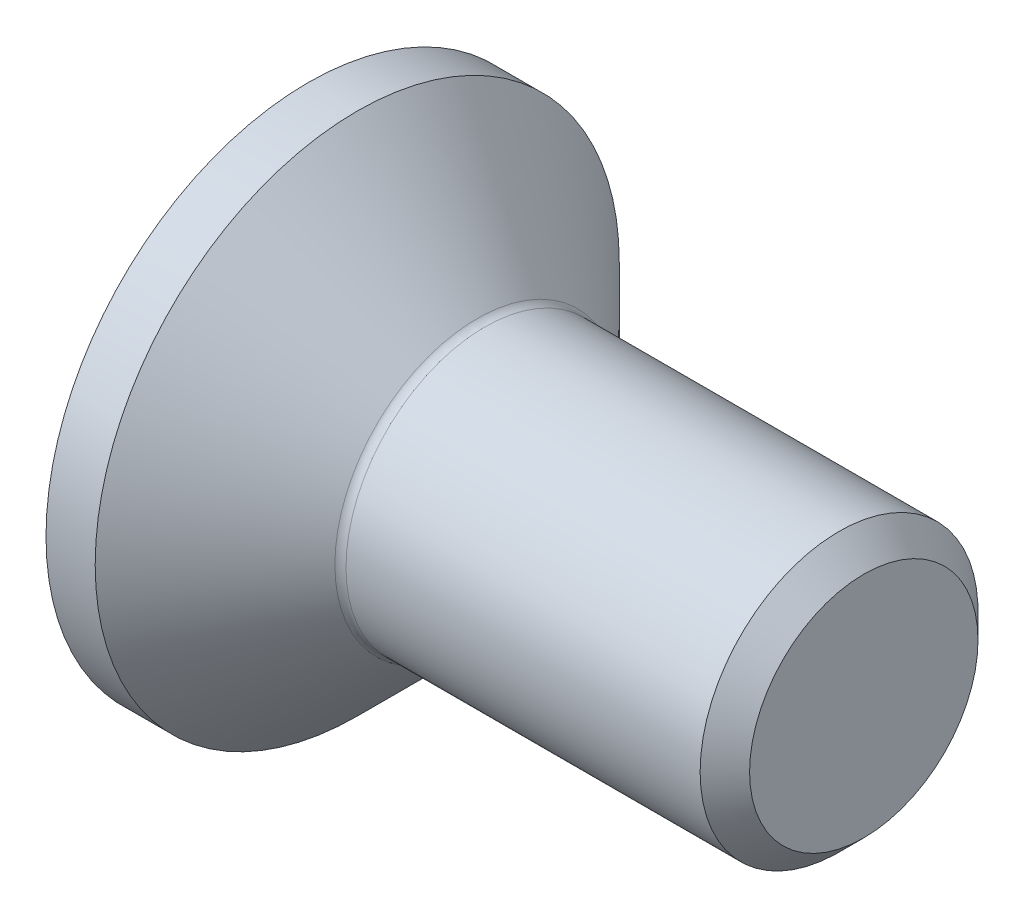
ISO-10303-21;
HEADER;
FILE_DESCRIPTION(('STEP AP214'),'2;1');
FILE_NAME('part.step','',(''),(''),'','','');
FILE_SCHEMA(('AUTOMOTIVE_DESIGN { 1 0 10303 214 1 1 1 1 }'));
ENDSEC;
DATA;
#1=APPLICATION_CONTEXT('core data for automotive mechanical design processes');
#2=APPLICATION_PROTOCOL_DEFINITION('international standard','automotive_design',2000,#1);
#3=PRODUCT_CONTEXT('',#1,'mechanical');
#4=PRODUCT('Part','Part','',(#3));
#5=PRODUCT_RELATED_PRODUCT_CATEGORY('part','',(#4));
#6=PRODUCT_DEFINITION_FORMATION('','',#4);
#7=PRODUCT_DEFINITION_CONTEXT('part definition',#1,'design');
#8=PRODUCT_DEFINITION('design','',#6,#7);
#9=PRODUCT_DEFINITION_SHAPE('','',#8);
#10=(LENGTH_UNIT() NAMED_UNIT(*) SI_UNIT(.MILLI.,.METRE.));
#11=(NAMED_UNIT(*) PLANE_ANGLE_UNIT() SI_UNIT($,.RADIAN.));
#12=(NAMED_UNIT(*) SI_UNIT($,.STERADIAN.) SOLID_ANGLE_UNIT());
#13=UNCERTAINTY_MEASURE_WITH_UNIT(LENGTH_MEASURE(1.E-05),#10,'distance_accuracy_value','');
#14=(GEOMETRIC_REPRESENTATION_CONTEXT(3) GLOBAL_UNCERTAINTY_ASSIGNED_CONTEXT((#13)) GLOBAL_UNIT_ASSIGNED_CONTEXT((#10,
#11,#12)) REPRESENTATION_CONTEXT('',''));
#15=CARTESIAN_POINT('',(0.,0.,0.));
#16=DIRECTION('',(0.,0.,1.));
#17=DIRECTION('',(1.,0.,0.));
#18=AXIS2_PLACEMENT_3D('',#15,#16,#17);
#19=CARTESIAN_POINT('',(0.,0.,0.));
#20=DIRECTION('',(-1.,0.,0.));
#21=DIRECTION('',(0.,0.,1.));
#22=AXIS2_PLACEMENT_3D('',#19,#20,#21);
#23=PLANE('',#22);
#24=CARTESIAN_POINT('',(0.,0.,0.));
#25=DIRECTION('',(-1.,0.,0.));
#26=DIRECTION('',(0.,0.,1.));
#27=AXIS2_PLACEMENT_3D('',#24,#25,#26);
#28=CIRCLE('',#27,4.715);
#29=CARTESIAN_POINT('',(0.,0.,4.715));
#30=VERTEX_POINT('',#29);
#31=EDGE_CURVE('E140',#30,#30,#28,.T.);
#32=ORIENTED_EDGE('',*,*,#31,.T.);
#33=EDGE_LOOP('',(#32));
#34=FACE_BOUND('',#33,.T.);
#35=DIRECTION('',(0.,-0.5,-0.866025403784439));
#36=VECTOR('',#35,1.);
#37=CARTESIAN_POINT('',(0.,-0.866025403784438,1.5));
#38=LINE('',#37,#36);
#39=CARTESIAN_POINT('',(0.,-0.866025403784438,1.5));
#40=VERTEX_POINT('',#39);
#41=CARTESIAN_POINT('',(0.,-1.73205080756887,0.));
#42=VERTEX_POINT('',#41);
#43=EDGE_CURVE('E102',#40,#42,#38,.T.);
#44=ORIENTED_EDGE('',*,*,#43,.T.);
#45=DIRECTION('',(0.,0.5,-0.866025403784439));
#46=VECTOR('',#45,1.);
#47=CARTESIAN_POINT('',(0.,-1.73205080756887,0.));
#48=LINE('',#47,#46);
#49=CARTESIAN_POINT('',(0.,-0.866025403784438,-1.5));
#50=VERTEX_POINT('',#49);
#51=EDGE_CURVE('E32',#42,#50,#48,.T.);
#52=ORIENTED_EDGE('',*,*,#51,.T.);
#53=DIRECTION('',(0.,1.,0.));
#54=VECTOR('',#53,1.);
#55=CARTESIAN_POINT('',(0.,-0.866025403784438,-1.5));
#56=LINE('',#55,#54);
#57=CARTESIAN_POINT('',(0.,0.866025403784438,-1.5));
#58=VERTEX_POINT('',#57);
#59=EDGE_CURVE('E117',#50,#58,#56,.T.);
#60=ORIENTED_EDGE('',*,*,#59,.T.);
#61=DIRECTION('',(0.,0.5,0.866025403784438));
#62=VECTOR('',#61,1.);
#63=CARTESIAN_POINT('',(0.,0.866025403784438,-1.5));
#64=LINE('',#63,#62);
#65=CARTESIAN_POINT('',(0.,1.73205080756888,0.));
#66=VERTEX_POINT('',#65);
#67=EDGE_CURVE('E258',#58,#66,#64,.T.);
#68=ORIENTED_EDGE('',*,*,#67,.T.);
#69=DIRECTION('',(0.,-0.5,0.866025403784438));
#70=VECTOR('',#69,1.);
#71=CARTESIAN_POINT('',(0.,1.73205080756888,0.));
#72=LINE('',#71,#70);
#73=CARTESIAN_POINT('',(0.,0.866025403784438,1.5));
#74=VERTEX_POINT('',#73);
#75=EDGE_CURVE('E261',#66,#74,#72,.T.);
#76=ORIENTED_EDGE('',*,*,#75,.T.);
#77=DIRECTION('',(0.,-1.,0.));
#78=VECTOR('',#77,1.);
#79=CARTESIAN_POINT('',(0.,0.866025403784438,1.5));
#80=LINE('',#79,#78);
#81=EDGE_CURVE('E264',#74,#40,#80,.T.);
#82=ORIENTED_EDGE('',*,*,#81,.T.);
#83=EDGE_LOOP('',(#44,#52,#60,#68,#76,#82));
#84=FACE_BOUND('',#83,.T.);
#85=ADVANCED_FACE('F17',(#34,#84),#23,.T.);
#86=CARTESIAN_POINT('',(0.,0.,0.));
#87=DIRECTION('',(-1.,0.,0.));
#88=DIRECTION('',(0.,0.,1.));
#89=AXIS2_PLACEMENT_3D('',#86,#87,#88);
#90=CYLINDRICAL_SURFACE('',#89,4.715);
#91=CARTESIAN_POINT('',(0.885000000000013,0.,0.));
#92=DIRECTION('',(-1.,0.,0.));
#93=DIRECTION('',(0.,0.,1.));
#94=AXIS2_PLACEMENT_3D('',#91,#92,#93);
#95=CIRCLE('',#94,4.715);
#96=CARTESIAN_POINT('',(0.885000000000013,0.,4.715));
#97=VERTEX_POINT('',#96);
#98=EDGE_CURVE('E137',#97,#97,#95,.T.);
#99=ORIENTED_EDGE('',*,*,#98,.T.);
#100=EDGE_LOOP('',(#99));
#101=FACE_BOUND('',#100,.T.);
#102=ORIENTED_EDGE('',*,*,#31,.F.);
#103=EDGE_LOOP('',(#102));
#104=FACE_BOUND('',#103,.T.);
#105=ADVANCED_FACE('F163',(#101,#104),#90,.T.);
#106=CARTESIAN_POINT('',(0.885000000000013,0.,0.));
#107=DIRECTION('',(-1.,0.,0.));
#108=DIRECTION('',(0.,0.,1.));
#109=AXIS2_PLACEMENT_3D('',#106,#107,#108);
#110=CONICAL_SURFACE('',#109,4.715,0.78539816339745);
#111=CARTESIAN_POINT('',(3.04142135623731,0.,0.));
#112=DIRECTION('',(-1.,0.,0.));
#113=DIRECTION('',(0.,0.,1.));
#114=AXIS2_PLACEMENT_3D('',#111,#112,#113);
#115=CIRCLE('',#114,2.55857864376269);
#116=CARTESIAN_POINT('',(3.04142135623731,0.,2.55857864376269));
#117=VERTEX_POINT('',#116);
#118=EDGE_CURVE('E25',#117,#117,#115,.T.);
#119=ORIENTED_EDGE('',*,*,#118,.T.);
#120=EDGE_LOOP('',(#119));
#121=FACE_BOUND('',#120,.T.);
#122=ORIENTED_EDGE('',*,*,#98,.F.);
#123=EDGE_LOOP('',(#122));
#124=FACE_BOUND('',#123,.T.);
#125=ADVANCED_FACE('F145',(#121,#124),#110,.T.);
#126=CARTESIAN_POINT('',(0.,0.,0.));
#127=DIRECTION('',(-1.,0.,0.));
#128=DIRECTION('',(0.,0.,1.));
#129=AXIS2_PLACEMENT_3D('',#126,#127,#128);
#130=CYLINDRICAL_SURFACE('',#129,2.5);
#131=CARTESIAN_POINT('',(3.18284271247462,0.,0.));
#132=DIRECTION('',(-1.,0.,0.));
#133=DIRECTION('',(0.,0.,1.));
#134=AXIS2_PLACEMENT_3D('',#131,#132,#133);
#135=CIRCLE('',#134,2.5);
#136=CARTESIAN_POINT('',(3.18284271247462,0.,2.5));
#137=VERTEX_POINT('',#136);
#138=EDGE_CURVE('E11',#137,#137,#135,.F.);
#139=ORIENTED_EDGE('',*,*,#138,.T.);
#140=EDGE_LOOP('',(#139));
#141=FACE_BOUND('',#140,.T.);
#142=CARTESIAN_POINT('',(9.555,0.,0.));
#143=DIRECTION('',(-1.,0.,0.));
#144=DIRECTION('',(0.,0.,1.));
#145=AXIS2_PLACEMENT_3D('',#142,#143,#144);
#146=CIRCLE('',#145,2.5);
#147=CARTESIAN_POINT('',(9.555,0.,2.5));
#148=VERTEX_POINT('',#147);
#149=EDGE_CURVE('E134',#148,#148,#146,.T.);
#150=ORIENTED_EDGE('',*,*,#149,.T.);
#151=EDGE_LOOP('',(#150));
#152=FACE_BOUND('',#151,.T.);
#153=ADVANCED_FACE('F175',(#141,#152),#130,.T.);
#154=CARTESIAN_POINT('',(10.,0.,0.));
#155=DIRECTION('',(-1.,0.,0.));
#156=DIRECTION('',(0.,0.,1.));
#157=AXIS2_PLACEMENT_3D('',#154,#155,#156);
#158=CONICAL_SURFACE('',#157,2.055,0.785398163397449);
#159=ORIENTED_EDGE('',*,*,#149,.F.);
#160=EDGE_LOOP('',(#159));
#161=FACE_BOUND('',#160,.T.);
#162=CARTESIAN_POINT('',(10.,0.,0.));
#163=DIRECTION('',(-1.,0.,0.));
#164=DIRECTION('',(0.,0.,1.));
#165=AXIS2_PLACEMENT_3D('',#162,#163,#164);
#166=CIRCLE('',#165,2.055);
#167=CARTESIAN_POINT('',(10.,0.,2.055));
#168=VERTEX_POINT('',#167);
#169=EDGE_CURVE('E130',#168,#168,#166,.T.);
#170=ORIENTED_EDGE('',*,*,#169,.T.);
#171=EDGE_LOOP('',(#170));
#172=FACE_BOUND('',#171,.T.);
#173=ADVANCED_FACE('F158',(#161,#172),#158,.T.);
#174=CARTESIAN_POINT('',(10.,2.055,0.));
#175=DIRECTION('',(1.,0.,0.));
#176=DIRECTION('',(0.,0.,-1.));
#177=AXIS2_PLACEMENT_3D('',#174,#175,#176);
#178=PLANE('',#177);
#179=ORIENTED_EDGE('',*,*,#169,.F.);
#180=EDGE_LOOP('',(#179));
#181=FACE_BOUND('',#180,.T.);
#182=ADVANCED_FACE('F149',(#181),#178,.T.);
#183=CARTESIAN_POINT('',(3.18284271247462,0.,0.));
#184=DIRECTION('',(-1.,0.,0.));
#185=DIRECTION('',(0.,0.,1.));
#186=AXIS2_PLACEMENT_3D('',#183,#184,#185);
#187=TOROIDAL_SURFACE('',#186,2.7,0.2);
#188=ORIENTED_EDGE('',*,*,#138,.F.);
#189=EDGE_LOOP('',(#188));
#190=FACE_BOUND('',#189,.T.);
#191=ORIENTED_EDGE('',*,*,#118,.F.);
#192=EDGE_LOOP('',(#191));
#193=FACE_BOUND('',#192,.T.);
#194=ADVANCED_FACE('F19',(#190,#193),#187,.F.);
#195=CARTESIAN_POINT('',(1.9,-1.73205080756887,0.));
#196=DIRECTION('',(0.,0.866025403784439,0.5));
#197=DIRECTION('',(0.,-0.5,0.866025403784439));
#198=AXIS2_PLACEMENT_3D('',#195,#196,#197);
#199=PLANE('',#198);
#200=ORIENTED_EDGE('',*,*,#51,.F.);
#201=DIRECTION('',(-1.,0.,0.));
#202=VECTOR('',#201,1.);
#203=CARTESIAN_POINT('',(1.9,-1.73205080756887,0.));
#204=LINE('',#203,#202);
#205=CARTESIAN_POINT('',(1.9,-1.73205080756887,0.));
#206=VERTEX_POINT('',#205);
#207=EDGE_CURVE('E255',#206,#42,#204,.T.);
#208=ORIENTED_EDGE('',*,*,#207,.F.);
#209=DIRECTION('',(0.,0.5,-0.866025403784439));
#210=VECTOR('',#209,1.);
#211=CARTESIAN_POINT('',(1.9,-1.73205080756887,0.));
#212=LINE('',#211,#210);
#213=CARTESIAN_POINT('',(1.9,-1.29903810567666,-0.75));
#214=VERTEX_POINT('',#213);
#215=EDGE_CURVE('E99',#206,#214,#212,.T.);
#216=ORIENTED_EDGE('',*,*,#215,.T.);
#217=CARTESIAN_POINT('',(1.9,-0.866025403784438,-1.5));
#218=VERTEX_POINT('',#217);
#219=EDGE_CURVE('E93',#214,#218,#212,.T.);
#220=ORIENTED_EDGE('',*,*,#219,.T.);
#221=DIRECTION('',(-1.,0.,0.));
#222=VECTOR('',#221,1.);
#223=CARTESIAN_POINT('',(1.9,-0.866025403784438,-1.5));
#224=LINE('',#223,#222);
#225=EDGE_CURVE('E97',#218,#50,#224,.T.);
#226=ORIENTED_EDGE('',*,*,#225,.T.);
#227=EDGE_LOOP('',(#200,#208,#216,#220,#226));
#228=FACE_BOUND('',#227,.T.);
#229=ADVANCED_FACE('F95',(#228),#199,.T.);
#230=CARTESIAN_POINT('',(1.9,-0.866025403784438,-1.5));
#231=DIRECTION('',(0.,0.,1.));
#232=DIRECTION('',(0.,-1.,0.));
#233=AXIS2_PLACEMENT_3D('',#230,#231,#232);
#234=PLANE('',#233);
#235=ORIENTED_EDGE('',*,*,#59,.F.);
#236=ORIENTED_EDGE('',*,*,#225,.F.);
#237=DIRECTION('',(0.,1.,0.));
#238=VECTOR('',#237,1.);
#239=CARTESIAN_POINT('',(1.9,-0.866025403784438,-1.5));
#240=LINE('',#239,#238);
#241=CARTESIAN_POINT('',(1.9,0.,-1.5));
#242=VERTEX_POINT('',#241);
#243=EDGE_CURVE('E105',#218,#242,#240,.T.);
#244=ORIENTED_EDGE('',*,*,#243,.T.);
#245=CARTESIAN_POINT('',(1.9,0.866025403784438,-1.5));
#246=VERTEX_POINT('',#245);
#247=EDGE_CURVE('E112',#242,#246,#240,.T.);
#248=ORIENTED_EDGE('',*,*,#247,.T.);
#249=DIRECTION('',(-1.,0.,0.));
#250=VECTOR('',#249,1.);
#251=CARTESIAN_POINT('',(1.9,0.866025403784438,-1.5));
#252=LINE('',#251,#250);
#253=EDGE_CURVE('E119',#246,#58,#252,.T.);
#254=ORIENTED_EDGE('',*,*,#253,.T.);
#255=EDGE_LOOP('',(#235,#236,#244,#248,#254));
#256=FACE_BOUND('',#255,.T.);
#257=ADVANCED_FACE('F114',(#256),#234,.T.);
#258=CARTESIAN_POINT('',(1.9,0.866025403784438,-1.5));
#259=DIRECTION('',(0.,-0.866025403784438,0.5));
#260=DIRECTION('',(0.,-0.5,-0.866025403784438));
#261=AXIS2_PLACEMENT_3D('',#258,#259,#260);
#262=PLANE('',#261);
#263=ORIENTED_EDGE('',*,*,#67,.F.);
#264=ORIENTED_EDGE('',*,*,#253,.F.);
#265=DIRECTION('',(0.,0.5,0.866025403784438));
#266=VECTOR('',#265,1.);
#267=CARTESIAN_POINT('',(1.9,0.866025403784438,-1.5));
#268=LINE('',#267,#266);
#269=CARTESIAN_POINT('',(1.9,1.29903810567666,-0.75));
#270=VERTEX_POINT('',#269);
#271=EDGE_CURVE('E247',#246,#270,#268,.T.);
#272=ORIENTED_EDGE('',*,*,#271,.T.);
#273=CARTESIAN_POINT('',(1.9,1.73205080756888,0.));
#274=VERTEX_POINT('',#273);
#275=EDGE_CURVE('E111',#270,#274,#268,.T.);
#276=ORIENTED_EDGE('',*,*,#275,.T.);
#277=DIRECTION('',(-1.,0.,0.));
#278=VECTOR('',#277,1.);
#279=CARTESIAN_POINT('',(1.9,1.73205080756888,0.));
#280=LINE('',#279,#278);
#281=EDGE_CURVE('E125',#274,#66,#280,.T.);
#282=ORIENTED_EDGE('',*,*,#281,.T.);
#283=EDGE_LOOP('',(#263,#264,#272,#276,#282));
#284=FACE_BOUND('',#283,.T.);
#285=ADVANCED_FACE('F189',(#284),#262,.T.);
#286=CARTESIAN_POINT('',(1.9,1.73205080756888,0.));
#287=DIRECTION('',(0.,-0.866025403784439,-0.5));
#288=DIRECTION('',(0.,0.5,-0.866025403784439));
#289=AXIS2_PLACEMENT_3D('',#286,#287,#288);
#290=PLANE('',#289);
#291=ORIENTED_EDGE('',*,*,#75,.F.);
#292=ORIENTED_EDGE('',*,*,#281,.F.);
#293=DIRECTION('',(0.,-0.5,0.866025403784438));
#294=VECTOR('',#293,1.);
#295=CARTESIAN_POINT('',(1.9,1.73205080756888,0.));
#296=LINE('',#295,#294);
#297=CARTESIAN_POINT('',(1.9,1.29903810567666,0.75));
#298=VERTEX_POINT('',#297);
#299=EDGE_CURVE('E40',#274,#298,#296,.T.);
#300=ORIENTED_EDGE('',*,*,#299,.T.);
#301=CARTESIAN_POINT('',(1.9,0.866025403784438,1.5));
#302=VERTEX_POINT('',#301);
#303=EDGE_CURVE('E226',#298,#302,#296,.T.);
#304=ORIENTED_EDGE('',*,*,#303,.T.);
#305=DIRECTION('',(-1.,0.,0.));
#306=VECTOR('',#305,1.);
#307=CARTESIAN_POINT('',(1.9,0.866025403784438,1.5));
#308=LINE('',#307,#306);
#309=EDGE_CURVE('E240',#302,#74,#308,.T.);
#310=ORIENTED_EDGE('',*,*,#309,.T.);
#311=EDGE_LOOP('',(#291,#292,#300,#304,#310));
#312=FACE_BOUND('',#311,.T.);
#313=ADVANCED_FACE('F192',(#312),#290,.T.);
#314=CARTESIAN_POINT('',(1.9,0.866025403784438,1.5));
#315=DIRECTION('',(0.,0.,-1.));
#316=DIRECTION('',(-1.,0.,0.));
#317=AXIS2_PLACEMENT_3D('',#314,#315,#316);
#318=PLANE('',#317);
#319=ORIENTED_EDGE('',*,*,#81,.F.);
#320=ORIENTED_EDGE('',*,*,#309,.F.);
#321=DIRECTION('',(0.,-1.,0.));
#322=VECTOR('',#321,1.);
#323=CARTESIAN_POINT('',(1.9,0.866025403784438,1.5));
#324=LINE('',#323,#322);
#325=CARTESIAN_POINT('',(1.9,0.,1.5));
#326=VERTEX_POINT('',#325);
#327=EDGE_CURVE('E225',#302,#326,#324,.T.);
#328=ORIENTED_EDGE('',*,*,#327,.T.);
#329=CARTESIAN_POINT('',(1.9,-0.866025403784438,1.5));
#330=VERTEX_POINT('',#329);
#331=EDGE_CURVE('E231',#326,#330,#324,.T.);
#332=ORIENTED_EDGE('',*,*,#331,.T.);
#333=DIRECTION('',(-1.,0.,0.));
#334=VECTOR('',#333,1.);
#335=CARTESIAN_POINT('',(1.9,-0.866025403784438,1.5));
#336=LINE('',#335,#334);
#337=EDGE_CURVE('E270',#330,#40,#336,.T.);
#338=ORIENTED_EDGE('',*,*,#337,.T.);
#339=EDGE_LOOP('',(#319,#320,#328,#332,#338));
#340=FACE_BOUND('',#339,.T.);
#341=ADVANCED_FACE('F196',(#340),#318,.T.);
#342=CARTESIAN_POINT('',(1.9,-0.866025403784438,1.5));
#343=DIRECTION('',(0.,0.866025403784439,-0.5));
#344=DIRECTION('',(0.,0.5,0.86602540378444));
#345=AXIS2_PLACEMENT_3D('',#342,#343,#344);
#346=PLANE('',#345);
#347=ORIENTED_EDGE('',*,*,#43,.F.);
#348=ORIENTED_EDGE('',*,*,#337,.F.);
#349=DIRECTION('',(0.,-0.5,-0.866025403784439));
#350=VECTOR('',#349,1.);
#351=CARTESIAN_POINT('',(1.9,-0.866025403784438,1.5));
#352=LINE('',#351,#350);
#353=CARTESIAN_POINT('',(1.9,-1.29903810567666,0.75));
#354=VERTEX_POINT('',#353);
#355=EDGE_CURVE('E234',#330,#354,#352,.T.);
#356=ORIENTED_EDGE('',*,*,#355,.T.);
#357=EDGE_CURVE('E241',#354,#206,#352,.T.);
#358=ORIENTED_EDGE('',*,*,#357,.T.);
#359=ORIENTED_EDGE('',*,*,#207,.T.);
#360=EDGE_LOOP('',(#347,#348,#356,#358,#359));
#361=FACE_BOUND('',#360,.T.);
#362=ADVANCED_FACE('F199',(#361),#346,.T.);
#363=CARTESIAN_POINT('',(1.9,-2.59807621135331,1.5));
#364=DIRECTION('',(-1.,0.,0.));
#365=DIRECTION('',(0.,0.,1.));
#366=AXIS2_PLACEMENT_3D('',#363,#364,#365);
#367=PLANE('',#366);
#368=CARTESIAN_POINT('',(1.9,0.,0.));
#369=DIRECTION('',(-1.,0.,0.));
#370=DIRECTION('',(0.,0.,1.));
#371=AXIS2_PLACEMENT_3D('',#368,#369,#370);
#372=CIRCLE('',#371,1.5);
#373=EDGE_CURVE('E118',#354,#326,#372,.T.);
#374=ORIENTED_EDGE('',*,*,#373,.F.);
#375=ORIENTED_EDGE('',*,*,#355,.F.);
#376=ORIENTED_EDGE('',*,*,#331,.F.);
#377=EDGE_LOOP('',(#374,#375,#376));
#378=FACE_BOUND('',#377,.T.);
#379=ADVANCED_FACE('F203',(#378),#367,.T.);
#380=EDGE_CURVE('E122',#214,#354,#372,.T.);
#381=ORIENTED_EDGE('',*,*,#380,.F.);
#382=ORIENTED_EDGE('',*,*,#215,.F.);
#383=ORIENTED_EDGE('',*,*,#357,.F.);
#384=EDGE_LOOP('',(#381,#382,#383));
#385=FACE_BOUND('',#384,.T.);
#386=ADVANCED_FACE('F206',(#385),#367,.T.);
#387=EDGE_CURVE('E107',#242,#214,#372,.T.);
#388=ORIENTED_EDGE('',*,*,#387,.F.);
#389=ORIENTED_EDGE('',*,*,#243,.F.);
#390=ORIENTED_EDGE('',*,*,#219,.F.);
#391=EDGE_LOOP('',(#388,#389,#390));
#392=FACE_BOUND('',#391,.T.);
#393=ADVANCED_FACE('F106',(#392),#367,.T.);
#394=EDGE_CURVE('E243',#270,#242,#372,.T.);
#395=ORIENTED_EDGE('',*,*,#394,.F.);
#396=ORIENTED_EDGE('',*,*,#271,.F.);
#397=ORIENTED_EDGE('',*,*,#247,.F.);
#398=EDGE_LOOP('',(#395,#396,#397));
#399=FACE_BOUND('',#398,.T.);
#400=ADVANCED_FACE('F220',(#399),#367,.T.);
#401=EDGE_CURVE('E131',#298,#270,#372,.T.);
#402=ORIENTED_EDGE('',*,*,#401,.F.);
#403=ORIENTED_EDGE('',*,*,#299,.F.);
#404=ORIENTED_EDGE('',*,*,#275,.F.);
#405=EDGE_LOOP('',(#402,#403,#404));
#406=FACE_BOUND('',#405,.T.);
#407=ADVANCED_FACE('F214',(#406),#367,.T.);
#408=EDGE_CURVE('E124',#326,#298,#372,.T.);
#409=ORIENTED_EDGE('',*,*,#408,.F.);
#410=ORIENTED_EDGE('',*,*,#327,.F.);
#411=ORIENTED_EDGE('',*,*,#303,.F.);
#412=EDGE_LOOP('',(#409,#410,#411));
#413=FACE_BOUND('',#412,.T.);
#414=ADVANCED_FACE('F184',(#413),#367,.T.);
#415=CARTESIAN_POINT('',(1.9,0.,0.));
#416=DIRECTION('',(-1.,0.,0.));
#417=DIRECTION('',(0.,0.,1.));
#418=AXIS2_PLACEMENT_3D('',#415,#416,#417);
#419=CONICAL_SURFACE('',#418,1.5,1.0471975511966);
#420=CARTESIAN_POINT('',(2.76602540378445,0.,0.));
#421=VERTEX_POINT('',#420);
#422=VERTEX_LOOP('',#421);
#423=FACE_BOUND('',#422,.T.);
#424=ORIENTED_EDGE('',*,*,#408,.T.);
#425=ORIENTED_EDGE('',*,*,#401,.T.);
#426=ORIENTED_EDGE('',*,*,#394,.T.);
#427=ORIENTED_EDGE('',*,*,#387,.T.);
#428=ORIENTED_EDGE('',*,*,#380,.T.);
#429=ORIENTED_EDGE('',*,*,#373,.T.);
#430=EDGE_LOOP('',(#424,#425,#426,#427,#428,#429));
#431=FACE_BOUND('',#430,.T.);
#432=ADVANCED_FACE('F182',(#423,#431),#419,.F.);
#433=CLOSED_SHELL('',(#85,#105,#125,#153,#173,#182,#194,#229,#257,#285,#313,#341,#362,#379,#386,
#393,#400,#407,#414,#432));
#434=MANIFOLD_SOLID_BREP('B1',#433);
#435=ADVANCED_BREP_SHAPE_REPRESENTATION('',(#18,#434),#14);
#436=SHAPE_DEFINITION_REPRESENTATION(#9,#435);
ENDSEC;
END-ISO-10303-21;
